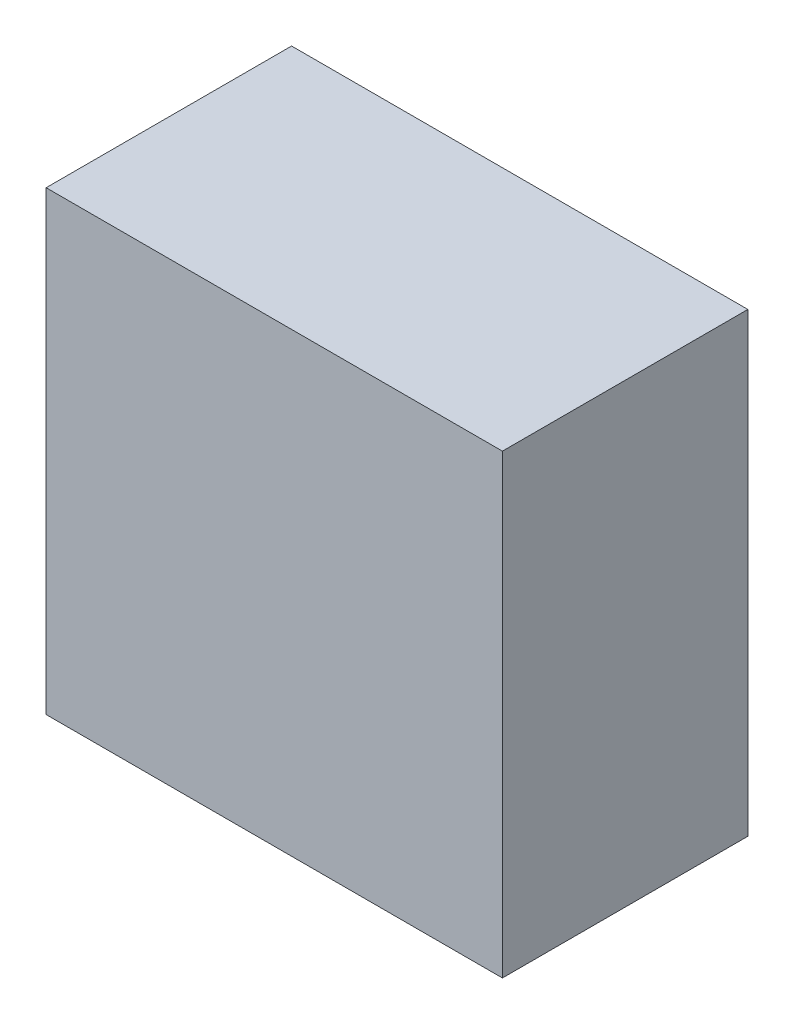
ISO-10303-21;
HEADER;
FILE_DESCRIPTION(('STEP AP214'),'2;1');
FILE_NAME('part.step','',(''),(''),'','','');
FILE_SCHEMA(('AUTOMOTIVE_DESIGN { 1 0 10303 214 1 1 1 1 }'));
ENDSEC;
DATA;
#1=APPLICATION_CONTEXT('core data for automotive mechanical design processes');
#2=APPLICATION_PROTOCOL_DEFINITION('international standard','automotive_design',2000,#1);
#3=PRODUCT_CONTEXT('',#1,'mechanical');
#4=PRODUCT('Part','Part','',(#3));
#5=PRODUCT_RELATED_PRODUCT_CATEGORY('part','',(#4));
#6=PRODUCT_DEFINITION_FORMATION('','',#4);
#7=PRODUCT_DEFINITION_CONTEXT('part definition',#1,'design');
#8=PRODUCT_DEFINITION('design','',#6,#7);
#9=PRODUCT_DEFINITION_SHAPE('','',#8);
#10=(LENGTH_UNIT() NAMED_UNIT(*) SI_UNIT(.MILLI.,.METRE.));
#11=(NAMED_UNIT(*) PLANE_ANGLE_UNIT() SI_UNIT($,.RADIAN.));
#12=(NAMED_UNIT(*) SI_UNIT($,.STERADIAN.) SOLID_ANGLE_UNIT());
#13=UNCERTAINTY_MEASURE_WITH_UNIT(LENGTH_MEASURE(1.E-05),#10,'distance_accuracy_value','');
#14=(GEOMETRIC_REPRESENTATION_CONTEXT(3) GLOBAL_UNCERTAINTY_ASSIGNED_CONTEXT((#13)) GLOBAL_UNIT_ASSIGNED_CONTEXT((#10,
#11,#12)) REPRESENTATION_CONTEXT('',''));
#15=CARTESIAN_POINT('',(0.,0.,0.));
#16=DIRECTION('',(0.,0.,1.));
#17=DIRECTION('',(1.,0.,0.));
#18=AXIS2_PLACEMENT_3D('',#15,#16,#17);
#19=CARTESIAN_POINT('',(600.,72.4999999999983,78.));
#20=DIRECTION('',(-1.,0.,0.));
#21=DIRECTION('',(0.,0.,1.));
#22=AXIS2_PLACEMENT_3D('',#19,#20,#21);
#23=PLANE('',#22);
#24=DIRECTION('',(0.,1.,0.));
#25=VECTOR('',#24,1.);
#26=CARTESIAN_POINT('',(600.,72.4999999999983,0.));
#27=LINE('',#26,#25);
#28=CARTESIAN_POINT('',(600.,-72.5000000000017,0.));
#29=VERTEX_POINT('',#28);
#30=CARTESIAN_POINT('',(600.,72.4999999999983,0.));
#31=VERTEX_POINT('',#30);
#32=EDGE_CURVE('E95',#29,#31,#27,.T.);
#33=ORIENTED_EDGE('',*,*,#32,.T.);
#34=DIRECTION('',(0.,0.,-1.));
#35=VECTOR('',#34,1.);
#36=CARTESIAN_POINT('',(600.,72.4999999999983,78.));
#37=LINE('',#36,#35);
#38=CARTESIAN_POINT('',(600.,72.4999999999983,78.));
#39=VERTEX_POINT('',#38);
#40=EDGE_CURVE('E11',#39,#31,#37,.T.);
#41=ORIENTED_EDGE('',*,*,#40,.F.);
#42=DIRECTION('',(0.,1.,0.));
#43=VECTOR('',#42,1.);
#44=CARTESIAN_POINT('',(600.,72.4999999999983,78.));
#45=LINE('',#44,#43);
#46=CARTESIAN_POINT('',(600.,-72.5000000000017,78.));
#47=VERTEX_POINT('',#46);
#48=EDGE_CURVE('E83',#47,#39,#45,.T.);
#49=ORIENTED_EDGE('',*,*,#48,.F.);
#50=DIRECTION('',(0.,0.,-1.));
#51=VECTOR('',#50,1.);
#52=CARTESIAN_POINT('',(600.,-72.5000000000017,78.));
#53=LINE('',#52,#51);
#54=EDGE_CURVE('E91',#47,#29,#53,.T.);
#55=ORIENTED_EDGE('',*,*,#54,.T.);
#56=EDGE_LOOP('',(#33,#41,#49,#55));
#57=FACE_BOUND('',#56,.T.);
#58=ADVANCED_FACE('F32',(#57),#23,.F.);
#59=CARTESIAN_POINT('',(600.,72.4999999999983,78.));
#60=DIRECTION('',(0.,-1.,0.));
#61=DIRECTION('',(0.,0.,-1.));
#62=AXIS2_PLACEMENT_3D('',#59,#60,#61);
#63=PLANE('',#62);
#64=DIRECTION('',(-1.,0.,0.));
#65=VECTOR('',#64,1.);
#66=CARTESIAN_POINT('',(600.,72.4999999999983,0.));
#67=LINE('',#66,#65);
#68=CARTESIAN_POINT('',(455.,72.4999999999983,0.));
#69=VERTEX_POINT('',#68);
#70=EDGE_CURVE('E87',#31,#69,#67,.T.);
#71=ORIENTED_EDGE('',*,*,#70,.T.);
#72=DIRECTION('',(0.,0.,-1.));
#73=VECTOR('',#72,1.);
#74=CARTESIAN_POINT('',(455.,72.4999999999983,78.));
#75=LINE('',#74,#73);
#76=CARTESIAN_POINT('',(455.,72.4999999999983,78.));
#77=VERTEX_POINT('',#76);
#78=EDGE_CURVE('E40',#77,#69,#75,.T.);
#79=ORIENTED_EDGE('',*,*,#78,.F.);
#80=DIRECTION('',(-1.,0.,0.));
#81=VECTOR('',#80,1.);
#82=CARTESIAN_POINT('',(600.,72.4999999999983,78.));
#83=LINE('',#82,#81);
#84=EDGE_CURVE('E78',#39,#77,#83,.T.);
#85=ORIENTED_EDGE('',*,*,#84,.F.);
#86=ORIENTED_EDGE('',*,*,#40,.T.);
#87=EDGE_LOOP('',(#71,#79,#85,#86));
#88=FACE_BOUND('',#87,.T.);
#89=ADVANCED_FACE('F86',(#88),#63,.F.);
#90=CARTESIAN_POINT('',(455.,72.4999999999983,78.));
#91=DIRECTION('',(1.,0.,0.));
#92=DIRECTION('',(0.,0.,-1.));
#93=AXIS2_PLACEMENT_3D('',#90,#91,#92);
#94=PLANE('',#93);
#95=DIRECTION('',(0.,-1.,0.));
#96=VECTOR('',#95,1.);
#97=CARTESIAN_POINT('',(455.,72.4999999999983,0.));
#98=LINE('',#97,#96);
#99=CARTESIAN_POINT('',(455.,-72.5000000000017,0.));
#100=VERTEX_POINT('',#99);
#101=EDGE_CURVE('E65',#69,#100,#98,.T.);
#102=ORIENTED_EDGE('',*,*,#101,.T.);
#103=DIRECTION('',(0.,0.,-1.));
#104=VECTOR('',#103,1.);
#105=CARTESIAN_POINT('',(455.,-72.5000000000017,78.));
#106=LINE('',#105,#104);
#107=CARTESIAN_POINT('',(455.,-72.5000000000017,78.));
#108=VERTEX_POINT('',#107);
#109=EDGE_CURVE('E88',#108,#100,#106,.T.);
#110=ORIENTED_EDGE('',*,*,#109,.F.);
#111=DIRECTION('',(0.,-1.,0.));
#112=VECTOR('',#111,1.);
#113=CARTESIAN_POINT('',(455.,72.4999999999983,78.));
#114=LINE('',#113,#112);
#115=EDGE_CURVE('E81',#77,#108,#114,.T.);
#116=ORIENTED_EDGE('',*,*,#115,.F.);
#117=ORIENTED_EDGE('',*,*,#78,.T.);
#118=EDGE_LOOP('',(#102,#110,#116,#117));
#119=FACE_BOUND('',#118,.T.);
#120=ADVANCED_FACE('F89',(#119),#94,.F.);
#121=CARTESIAN_POINT('',(600.,-72.5000000000017,78.));
#122=DIRECTION('',(0.,1.,0.));
#123=DIRECTION('',(-1.,0.,0.));
#124=AXIS2_PLACEMENT_3D('',#121,#122,#123);
#125=PLANE('',#124);
#126=DIRECTION('',(1.,0.,0.));
#127=VECTOR('',#126,1.);
#128=CARTESIAN_POINT('',(600.,-72.5000000000017,0.));
#129=LINE('',#128,#127);
#130=EDGE_CURVE('E71',#100,#29,#129,.T.);
#131=ORIENTED_EDGE('',*,*,#130,.T.);
#132=ORIENTED_EDGE('',*,*,#54,.F.);
#133=DIRECTION('',(1.,0.,0.));
#134=VECTOR('',#133,1.);
#135=CARTESIAN_POINT('',(600.,-72.5000000000017,78.));
#136=LINE('',#135,#134);
#137=EDGE_CURVE('E48',#108,#47,#136,.T.);
#138=ORIENTED_EDGE('',*,*,#137,.F.);
#139=ORIENTED_EDGE('',*,*,#109,.T.);
#140=EDGE_LOOP('',(#131,#132,#138,#139));
#141=FACE_BOUND('',#140,.T.);
#142=ADVANCED_FACE('F102',(#141),#125,.F.);
#143=CARTESIAN_POINT('',(600.,-72.5000000000017,78.));
#144=DIRECTION('',(0.,0.,-1.));
#145=DIRECTION('',(-1.,0.,0.));
#146=AXIS2_PLACEMENT_3D('',#143,#144,#145);
#147=PLANE('',#146);
#148=ORIENTED_EDGE('',*,*,#48,.T.);
#149=ORIENTED_EDGE('',*,*,#84,.T.);
#150=ORIENTED_EDGE('',*,*,#115,.T.);
#151=ORIENTED_EDGE('',*,*,#137,.T.);
#152=EDGE_LOOP('',(#148,#149,#150,#151));
#153=FACE_BOUND('',#152,.T.);
#154=ADVANCED_FACE('F79',(#153),#147,.F.);
#155=CARTESIAN_POINT('',(600.,-72.5000000000017,0.));
#156=DIRECTION('',(0.,0.,-1.));
#157=DIRECTION('',(-1.,0.,0.));
#158=AXIS2_PLACEMENT_3D('',#155,#156,#157);
#159=PLANE('',#158);
#160=ORIENTED_EDGE('',*,*,#32,.F.);
#161=ORIENTED_EDGE('',*,*,#130,.F.);
#162=ORIENTED_EDGE('',*,*,#101,.F.);
#163=ORIENTED_EDGE('',*,*,#70,.F.);
#164=EDGE_LOOP('',(#160,#161,#162,#163));
#165=FACE_BOUND('',#164,.T.);
#166=ADVANCED_FACE('F105',(#165),#159,.T.);
#167=CLOSED_SHELL('',(#58,#89,#120,#142,#154,#166));
#168=MANIFOLD_SOLID_BREP('B2',#167);
#169=ADVANCED_BREP_SHAPE_REPRESENTATION('',(#18,#168),#14);
#170=SHAPE_DEFINITION_REPRESENTATION(#9,#169);
ENDSEC;
END-ISO-10303-21;
